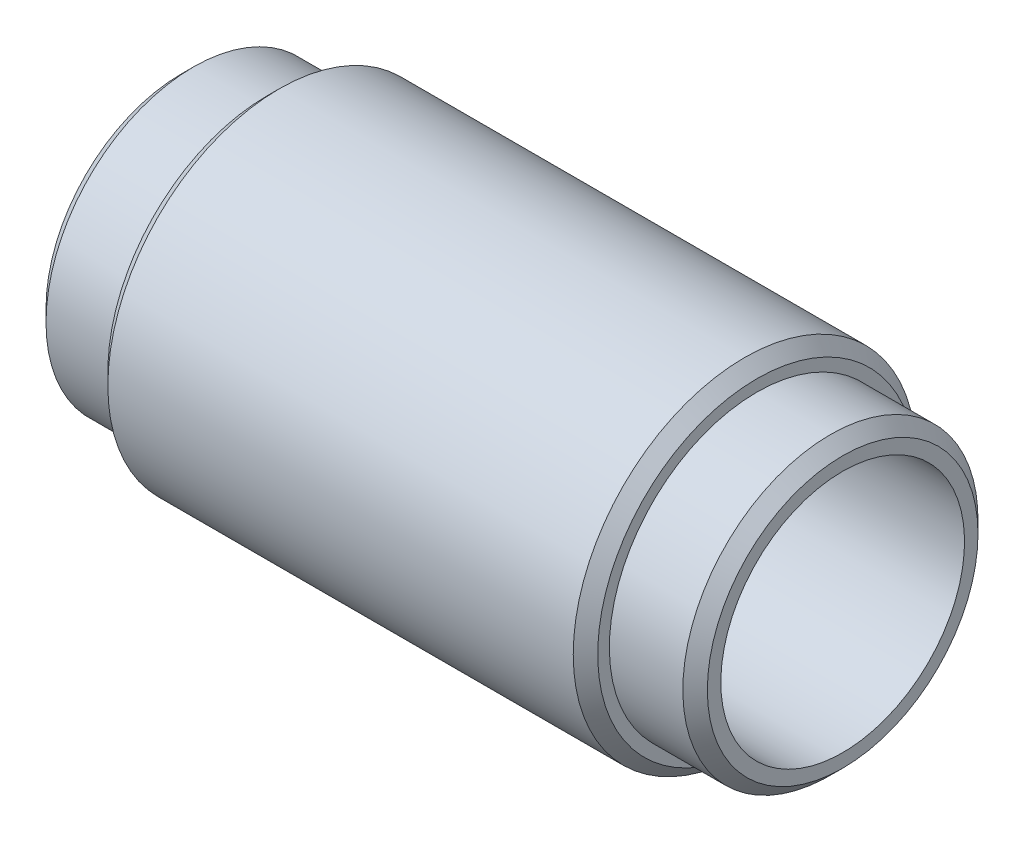
ISO-10303-21;
HEADER;
FILE_DESCRIPTION(('STEP AP214'),'2;1');
FILE_NAME('part.step','',(''),(''),'','','');
FILE_SCHEMA(('AUTOMOTIVE_DESIGN { 1 0 10303 214 1 1 1 1 }'));
ENDSEC;
DATA;
#1=APPLICATION_CONTEXT('core data for automotive mechanical design processes');
#2=APPLICATION_PROTOCOL_DEFINITION('international standard','automotive_design',2000,#1);
#3=PRODUCT_CONTEXT('',#1,'mechanical');
#4=PRODUCT('Part','Part','',(#3));
#5=PRODUCT_RELATED_PRODUCT_CATEGORY('part','',(#4));
#6=PRODUCT_DEFINITION_FORMATION('','',#4);
#7=PRODUCT_DEFINITION_CONTEXT('part definition',#1,'design');
#8=PRODUCT_DEFINITION('design','',#6,#7);
#9=PRODUCT_DEFINITION_SHAPE('','',#8);
#10=(LENGTH_UNIT() NAMED_UNIT(*) SI_UNIT(.MILLI.,.METRE.));
#11=(NAMED_UNIT(*) PLANE_ANGLE_UNIT() SI_UNIT($,.RADIAN.));
#12=(NAMED_UNIT(*) SI_UNIT($,.STERADIAN.) SOLID_ANGLE_UNIT());
#13=UNCERTAINTY_MEASURE_WITH_UNIT(LENGTH_MEASURE(1.E-05),#10,'distance_accuracy_value','');
#14=(GEOMETRIC_REPRESENTATION_CONTEXT(3) GLOBAL_UNCERTAINTY_ASSIGNED_CONTEXT((#13)) GLOBAL_UNIT_ASSIGNED_CONTEXT((#10,
#11,#12)) REPRESENTATION_CONTEXT('',''));
#15=CARTESIAN_POINT('',(0.,0.,0.));
#16=DIRECTION('',(0.,0.,1.));
#17=DIRECTION('',(1.,0.,0.));
#18=AXIS2_PLACEMENT_3D('',#15,#16,#17);
#19=CARTESIAN_POINT('',(-13.5,4.97499999999999,0.));
#20=DIRECTION('',(-1.,0.,0.));
#21=DIRECTION('',(0.,-1.,0.));
#22=AXIS2_PLACEMENT_3D('',#19,#20,#21);
#23=PLANE('',#22);
#24=CARTESIAN_POINT('',(-13.5,0.,0.));
#25=DIRECTION('',(-1.,0.,0.));
#26=DIRECTION('',(0.,-1.,0.));
#27=AXIS2_PLACEMENT_3D('',#24,#25,#26);
#28=CIRCLE('',#27,5.52499999999998);
#29=CARTESIAN_POINT('',(-13.5,-5.52499999999999,0.));
#30=VERTEX_POINT('',#29);
#31=EDGE_CURVE('E41',#30,#30,#28,.T.);
#32=ORIENTED_EDGE('',*,*,#31,.T.);
#33=EDGE_LOOP('',(#32));
#34=FACE_BOUND('',#33,.T.);
#35=CARTESIAN_POINT('',(-13.5,0.,0.));
#36=DIRECTION('',(1.,0.,0.));
#37=DIRECTION('',(0.,1.,0.));
#38=AXIS2_PLACEMENT_3D('',#35,#36,#37);
#39=CIRCLE('',#38,4.975);
#40=CARTESIAN_POINT('',(-13.5,4.97499999999999,0.));
#41=VERTEX_POINT('',#40);
#42=EDGE_CURVE('E75',#41,#41,#39,.T.);
#43=ORIENTED_EDGE('',*,*,#42,.T.);
#44=EDGE_LOOP('',(#43));
#45=FACE_BOUND('',#44,.T.);
#46=ADVANCED_FACE('F33',(#34,#45),#23,.T.);
#47=CARTESIAN_POINT('',(13.5,0.,0.));
#48=DIRECTION('',(1.,0.,0.));
#49=DIRECTION('',(0.,1.,0.));
#50=AXIS2_PLACEMENT_3D('',#47,#48,#49);
#51=CYLINDRICAL_SURFACE('',#50,6.025);
#52=CARTESIAN_POINT('',(-13.,0.,0.));
#53=DIRECTION('',(-1.,0.,0.));
#54=DIRECTION('',(0.,-1.,0.));
#55=AXIS2_PLACEMENT_3D('',#52,#53,#54);
#56=CIRCLE('',#55,6.025);
#57=CARTESIAN_POINT('',(-13.,-6.025,0.));
#58=VERTEX_POINT('',#57);
#59=EDGE_CURVE('E45',#58,#58,#56,.F.);
#60=ORIENTED_EDGE('',*,*,#59,.T.);
#61=EDGE_LOOP('',(#60));
#62=FACE_BOUND('',#61,.T.);
#63=CARTESIAN_POINT('',(-10.,0.,0.));
#64=DIRECTION('',(1.,0.,0.));
#65=DIRECTION('',(0.,1.,0.));
#66=AXIS2_PLACEMENT_3D('',#63,#64,#65);
#67=CIRCLE('',#66,6.025);
#68=CARTESIAN_POINT('',(-10.,6.02499999999999,0.));
#69=VERTEX_POINT('',#68);
#70=EDGE_CURVE('E66',#69,#69,#67,.T.);
#71=ORIENTED_EDGE('',*,*,#70,.F.);
#72=EDGE_LOOP('',(#71));
#73=FACE_BOUND('',#72,.T.);
#74=ADVANCED_FACE('F97',(#62,#73),#51,.T.);
#75=CARTESIAN_POINT('',(-10.,6.02499999999999,0.));
#76=DIRECTION('',(-1.,0.,0.));
#77=DIRECTION('',(0.,-1.,0.));
#78=AXIS2_PLACEMENT_3D('',#75,#76,#77);
#79=PLANE('',#78);
#80=CARTESIAN_POINT('',(-10.,0.,0.));
#81=DIRECTION('',(-1.,0.,0.));
#82=DIRECTION('',(0.,-1.,0.));
#83=AXIS2_PLACEMENT_3D('',#80,#81,#82);
#84=CIRCLE('',#83,6.49999999999999);
#85=CARTESIAN_POINT('',(-10.,-6.49999999999999,0.));
#86=VERTEX_POINT('',#85);
#87=EDGE_CURVE('E10',#86,#86,#84,.T.);
#88=ORIENTED_EDGE('',*,*,#87,.T.);
#89=EDGE_LOOP('',(#88));
#90=FACE_BOUND('',#89,.T.);
#91=ORIENTED_EDGE('',*,*,#70,.T.);
#92=EDGE_LOOP('',(#91));
#93=FACE_BOUND('',#92,.T.);
#94=ADVANCED_FACE('F102',(#90,#93),#79,.T.);
#95=CARTESIAN_POINT('',(13.5,0.,0.));
#96=DIRECTION('',(1.,0.,0.));
#97=DIRECTION('',(0.,1.,0.));
#98=AXIS2_PLACEMENT_3D('',#95,#96,#97);
#99=CYLINDRICAL_SURFACE('',#98,7.);
#100=CARTESIAN_POINT('',(9.49999999999999,0.,0.));
#101=DIRECTION('',(1.,0.,0.));
#102=DIRECTION('',(0.,1.,0.));
#103=AXIS2_PLACEMENT_3D('',#100,#101,#102);
#104=CIRCLE('',#103,7.);
#105=CARTESIAN_POINT('',(9.49999999999999,7.,0.));
#106=VERTEX_POINT('',#105);
#107=EDGE_CURVE('E49',#106,#106,#104,.F.);
#108=ORIENTED_EDGE('',*,*,#107,.T.);
#109=EDGE_LOOP('',(#108));
#110=FACE_BOUND('',#109,.T.);
#111=CARTESIAN_POINT('',(-9.49999999999999,0.,0.));
#112=DIRECTION('',(-1.,0.,0.));
#113=DIRECTION('',(0.,-1.,0.));
#114=AXIS2_PLACEMENT_3D('',#111,#112,#113);
#115=CIRCLE('',#114,7.);
#116=CARTESIAN_POINT('',(-9.49999999999999,-7.,0.));
#117=VERTEX_POINT('',#116);
#118=EDGE_CURVE('E54',#117,#117,#115,.F.);
#119=ORIENTED_EDGE('',*,*,#118,.T.);
#120=EDGE_LOOP('',(#119));
#121=FACE_BOUND('',#120,.T.);
#122=ADVANCED_FACE('F131',(#110,#121),#99,.T.);
#123=CARTESIAN_POINT('',(10.,6.025,0.));
#124=DIRECTION('',(1.,0.,0.));
#125=DIRECTION('',(0.,1.,0.));
#126=AXIS2_PLACEMENT_3D('',#123,#124,#125);
#127=PLANE('',#126);
#128=CARTESIAN_POINT('',(10.,0.,0.));
#129=DIRECTION('',(1.,0.,0.));
#130=DIRECTION('',(0.,1.,0.));
#131=AXIS2_PLACEMENT_3D('',#128,#129,#130);
#132=CIRCLE('',#131,6.5);
#133=CARTESIAN_POINT('',(10.,6.5,0.));
#134=VERTEX_POINT('',#133);
#135=EDGE_CURVE('E57',#134,#134,#132,.T.);
#136=ORIENTED_EDGE('',*,*,#135,.T.);
#137=EDGE_LOOP('',(#136));
#138=FACE_BOUND('',#137,.T.);
#139=CARTESIAN_POINT('',(10.,0.,0.));
#140=DIRECTION('',(1.,0.,0.));
#141=DIRECTION('',(0.,1.,0.));
#142=AXIS2_PLACEMENT_3D('',#139,#140,#141);
#143=CIRCLE('',#142,6.025);
#144=CARTESIAN_POINT('',(10.,6.025,0.));
#145=VERTEX_POINT('',#144);
#146=EDGE_CURVE('E69',#145,#145,#143,.T.);
#147=ORIENTED_EDGE('',*,*,#146,.F.);
#148=EDGE_LOOP('',(#147));
#149=FACE_BOUND('',#148,.T.);
#150=ADVANCED_FACE('F135',(#138,#149),#127,.T.);
#151=CARTESIAN_POINT('',(13.5,0.,0.));
#152=DIRECTION('',(1.,0.,0.));
#153=DIRECTION('',(0.,1.,0.));
#154=AXIS2_PLACEMENT_3D('',#151,#152,#153);
#155=CYLINDRICAL_SURFACE('',#154,6.025);
#156=CARTESIAN_POINT('',(13.,0.,0.));
#157=DIRECTION('',(1.,0.,0.));
#158=DIRECTION('',(0.,1.,0.));
#159=AXIS2_PLACEMENT_3D('',#156,#157,#158);
#160=CIRCLE('',#159,6.025);
#161=CARTESIAN_POINT('',(13.,6.025,0.));
#162=VERTEX_POINT('',#161);
#163=EDGE_CURVE('E60',#162,#162,#160,.F.);
#164=ORIENTED_EDGE('',*,*,#163,.T.);
#165=EDGE_LOOP('',(#164));
#166=FACE_BOUND('',#165,.T.);
#167=ORIENTED_EDGE('',*,*,#146,.T.);
#168=EDGE_LOOP('',(#167));
#169=FACE_BOUND('',#168,.T.);
#170=ADVANCED_FACE('F93',(#166,#169),#155,.T.);
#171=CARTESIAN_POINT('',(13.5,4.975,0.));
#172=DIRECTION('',(1.,0.,0.));
#173=DIRECTION('',(0.,1.,0.));
#174=AXIS2_PLACEMENT_3D('',#171,#172,#173);
#175=PLANE('',#174);
#176=CARTESIAN_POINT('',(13.5,0.,0.));
#177=DIRECTION('',(1.,0.,0.));
#178=DIRECTION('',(0.,1.,0.));
#179=AXIS2_PLACEMENT_3D('',#176,#177,#178);
#180=CIRCLE('',#179,5.52499999999999);
#181=CARTESIAN_POINT('',(13.5,5.525,0.));
#182=VERTEX_POINT('',#181);
#183=EDGE_CURVE('E63',#182,#182,#180,.T.);
#184=ORIENTED_EDGE('',*,*,#183,.T.);
#185=EDGE_LOOP('',(#184));
#186=FACE_BOUND('',#185,.T.);
#187=CARTESIAN_POINT('',(13.5,0.,0.));
#188=DIRECTION('',(1.,0.,0.));
#189=DIRECTION('',(0.,1.,0.));
#190=AXIS2_PLACEMENT_3D('',#187,#188,#189);
#191=CIRCLE('',#190,4.975);
#192=CARTESIAN_POINT('',(13.5,4.975,0.));
#193=VERTEX_POINT('',#192);
#194=EDGE_CURVE('E72',#193,#193,#191,.T.);
#195=ORIENTED_EDGE('',*,*,#194,.F.);
#196=EDGE_LOOP('',(#195));
#197=FACE_BOUND('',#196,.T.);
#198=ADVANCED_FACE('F83',(#186,#197),#175,.T.);
#199=CARTESIAN_POINT('',(13.5,0.,0.));
#200=DIRECTION('',(1.,0.,0.));
#201=DIRECTION('',(0.,1.,0.));
#202=AXIS2_PLACEMENT_3D('',#199,#200,#201);
#203=CYLINDRICAL_SURFACE('',#202,4.975);
#204=ORIENTED_EDGE('',*,*,#194,.T.);
#205=EDGE_LOOP('',(#204));
#206=FACE_BOUND('',#205,.T.);
#207=ORIENTED_EDGE('',*,*,#42,.F.);
#208=EDGE_LOOP('',(#207));
#209=FACE_BOUND('',#208,.T.);
#210=ADVANCED_FACE('F80',(#206,#209),#203,.F.);
#211=CARTESIAN_POINT('',(13.5,0.,0.));
#212=DIRECTION('',(-1.,0.,0.));
#213=DIRECTION('',(0.,-1.,0.));
#214=AXIS2_PLACEMENT_3D('',#211,#212,#213);
#215=CONICAL_SURFACE('',#214,5.52499999999999,0.785398163397448);
#216=ORIENTED_EDGE('',*,*,#163,.F.);
#217=EDGE_LOOP('',(#216));
#218=FACE_BOUND('',#217,.T.);
#219=ORIENTED_EDGE('',*,*,#183,.F.);
#220=EDGE_LOOP('',(#219));
#221=FACE_BOUND('',#220,.T.);
#222=ADVANCED_FACE('F82',(#218,#221),#215,.T.);
#223=CARTESIAN_POINT('',(10.,0.,0.));
#224=DIRECTION('',(-1.,0.,0.));
#225=DIRECTION('',(0.,-1.,0.));
#226=AXIS2_PLACEMENT_3D('',#223,#224,#225);
#227=CONICAL_SURFACE('',#226,6.5,0.785398163397447);
#228=ORIENTED_EDGE('',*,*,#107,.F.);
#229=EDGE_LOOP('',(#228));
#230=FACE_BOUND('',#229,.T.);
#231=ORIENTED_EDGE('',*,*,#135,.F.);
#232=EDGE_LOOP('',(#231));
#233=FACE_BOUND('',#232,.T.);
#234=ADVANCED_FACE('F90',(#230,#233),#227,.T.);
#235=CARTESIAN_POINT('',(-13.,0.,0.));
#236=DIRECTION('',(1.,0.,0.));
#237=DIRECTION('',(0.,1.,0.));
#238=AXIS2_PLACEMENT_3D('',#235,#236,#237);
#239=CONICAL_SURFACE('',#238,6.025,0.785398163397448);
#240=ORIENTED_EDGE('',*,*,#31,.F.);
#241=EDGE_LOOP('',(#240));
#242=FACE_BOUND('',#241,.T.);
#243=ORIENTED_EDGE('',*,*,#59,.F.);
#244=EDGE_LOOP('',(#243));
#245=FACE_BOUND('',#244,.T.);
#246=ADVANCED_FACE('F115',(#242,#245),#239,.T.);
#247=CARTESIAN_POINT('',(-9.49999999999999,0.,0.));
#248=DIRECTION('',(1.,0.,0.));
#249=DIRECTION('',(0.,1.,0.));
#250=AXIS2_PLACEMENT_3D('',#247,#248,#249);
#251=CONICAL_SURFACE('',#250,7.,0.785398163397447);
#252=ORIENTED_EDGE('',*,*,#87,.F.);
#253=EDGE_LOOP('',(#252));
#254=FACE_BOUND('',#253,.T.);
#255=ORIENTED_EDGE('',*,*,#118,.F.);
#256=EDGE_LOOP('',(#255));
#257=FACE_BOUND('',#256,.T.);
#258=ADVANCED_FACE('F36',(#254,#257),#251,.T.);
#259=CLOSED_SHELL('',(#46,#74,#94,#122,#150,#170,#198,#210,#222,#234,#246,#258));
#260=MANIFOLD_SOLID_BREP('B2',#259);
#261=ADVANCED_BREP_SHAPE_REPRESENTATION('',(#18,#260),#14);
#262=SHAPE_DEFINITION_REPRESENTATION(#9,#261);
ENDSEC;
END-ISO-10303-21;
